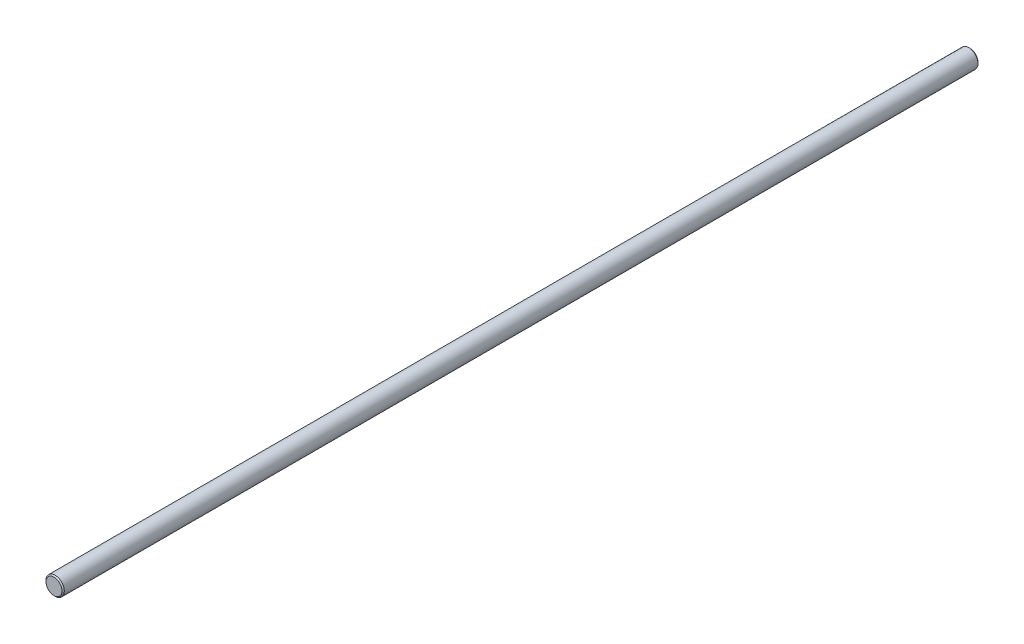
ISO-10303-21;
HEADER;
FILE_DESCRIPTION(('STEP AP214'),'2;1');
FILE_NAME('part.step','',(''),(''),'','','');
FILE_SCHEMA(('AUTOMOTIVE_DESIGN { 1 0 10303 214 1 1 1 1 }'));
ENDSEC;
DATA;
#1=APPLICATION_CONTEXT('core data for automotive mechanical design processes');
#2=APPLICATION_PROTOCOL_DEFINITION('international standard','automotive_design',2000,#1);
#3=PRODUCT_CONTEXT('',#1,'mechanical');
#4=PRODUCT('Part','Part','',(#3));
#5=PRODUCT_RELATED_PRODUCT_CATEGORY('part','',(#4));
#6=PRODUCT_DEFINITION_FORMATION('','',#4);
#7=PRODUCT_DEFINITION_CONTEXT('part definition',#1,'design');
#8=PRODUCT_DEFINITION('design','',#6,#7);
#9=PRODUCT_DEFINITION_SHAPE('','',#8);
#10=(LENGTH_UNIT() NAMED_UNIT(*) SI_UNIT(.MILLI.,.METRE.));
#11=(NAMED_UNIT(*) PLANE_ANGLE_UNIT() SI_UNIT($,.RADIAN.));
#12=(NAMED_UNIT(*) SI_UNIT($,.STERADIAN.) SOLID_ANGLE_UNIT());
#13=UNCERTAINTY_MEASURE_WITH_UNIT(LENGTH_MEASURE(1.E-05),#10,'distance_accuracy_value','');
#14=(GEOMETRIC_REPRESENTATION_CONTEXT(3) GLOBAL_UNCERTAINTY_ASSIGNED_CONTEXT((#13)) GLOBAL_UNIT_ASSIGNED_CONTEXT((#10,
#11,#12)) REPRESENTATION_CONTEXT('',''));
#15=CARTESIAN_POINT('',(0.,0.,0.));
#16=DIRECTION('',(0.,0.,1.));
#17=DIRECTION('',(1.,0.,0.));
#18=AXIS2_PLACEMENT_3D('',#15,#16,#17);
#19=CARTESIAN_POINT('',(0.,0.,400.));
#20=DIRECTION('',(0.,0.,-1.));
#21=DIRECTION('',(-1.,0.,0.));
#22=AXIS2_PLACEMENT_3D('',#19,#20,#21);
#23=CYLINDRICAL_SURFACE('',#22,4.);
#24=CARTESIAN_POINT('',(0.,0.,399.5));
#25=DIRECTION('',(0.,0.,1.));
#26=DIRECTION('',(1.,0.,0.));
#27=AXIS2_PLACEMENT_3D('',#24,#25,#26);
#28=CIRCLE('',#27,4.);
#29=CARTESIAN_POINT('',(4.,0.,399.5));
#30=VERTEX_POINT('',#29);
#31=EDGE_CURVE('E45',#30,#30,#28,.F.);
#32=ORIENTED_EDGE('',*,*,#31,.T.);
#33=EDGE_LOOP('',(#32));
#34=FACE_BOUND('',#33,.T.);
#35=CARTESIAN_POINT('',(0.,0.,0.5));
#36=DIRECTION('',(0.,0.,1.));
#37=DIRECTION('',(1.,0.,0.));
#38=AXIS2_PLACEMENT_3D('',#35,#36,#37);
#39=CIRCLE('',#38,4.);
#40=CARTESIAN_POINT('',(4.,0.,0.5));
#41=VERTEX_POINT('',#40);
#42=EDGE_CURVE('E51',#41,#41,#39,.T.);
#43=ORIENTED_EDGE('',*,*,#42,.T.);
#44=EDGE_LOOP('',(#43));
#45=FACE_BOUND('',#44,.T.);
#46=ADVANCED_FACE('F37',(#34,#45),#23,.T.);
#47=CARTESIAN_POINT('',(0.,0.,400.));
#48=DIRECTION('',(0.,0.,1.));
#49=DIRECTION('',(1.,0.,0.));
#50=AXIS2_PLACEMENT_3D('',#47,#48,#49);
#51=PLANE('',#50);
#52=CARTESIAN_POINT('',(0.,0.,400.));
#53=DIRECTION('',(0.,0.,1.));
#54=DIRECTION('',(1.,0.,0.));
#55=AXIS2_PLACEMENT_3D('',#52,#53,#54);
#56=CIRCLE('',#55,3.49999999999989);
#57=CARTESIAN_POINT('',(3.49999999999989,0.,400.));
#58=VERTEX_POINT('',#57);
#59=EDGE_CURVE('E56',#58,#58,#56,.T.);
#60=ORIENTED_EDGE('',*,*,#59,.T.);
#61=EDGE_LOOP('',(#60));
#62=FACE_BOUND('',#61,.T.);
#63=ADVANCED_FACE('F62',(#62),#51,.T.);
#64=CARTESIAN_POINT('',(0.,0.,0.));
#65=DIRECTION('',(0.,0.,1.));
#66=DIRECTION('',(1.,0.,0.));
#67=AXIS2_PLACEMENT_3D('',#64,#65,#66);
#68=PLANE('',#67);
#69=CARTESIAN_POINT('',(0.,0.,0.));
#70=DIRECTION('',(0.,0.,1.));
#71=DIRECTION('',(1.,0.,0.));
#72=AXIS2_PLACEMENT_3D('',#69,#70,#71);
#73=CIRCLE('',#72,3.49999999999995);
#74=CARTESIAN_POINT('',(3.49999999999995,0.,0.));
#75=VERTEX_POINT('',#74);
#76=EDGE_CURVE('E10',#75,#75,#73,.F.);
#77=ORIENTED_EDGE('',*,*,#76,.T.);
#78=EDGE_LOOP('',(#77));
#79=FACE_BOUND('',#78,.T.);
#80=ADVANCED_FACE('F66',(#79),#68,.F.);
#81=CARTESIAN_POINT('',(0.,0.,400.));
#82=DIRECTION('',(0.,0.,-1.));
#83=DIRECTION('',(-1.,0.,0.));
#84=AXIS2_PLACEMENT_3D('',#81,#82,#83);
#85=CONICAL_SURFACE('',#84,3.49999999999989,0.7853981633975);
#86=ORIENTED_EDGE('',*,*,#31,.F.);
#87=EDGE_LOOP('',(#86));
#88=FACE_BOUND('',#87,.T.);
#89=ORIENTED_EDGE('',*,*,#59,.F.);
#90=EDGE_LOOP('',(#89));
#91=FACE_BOUND('',#90,.T.);
#92=ADVANCED_FACE('F64',(#88,#91),#85,.T.);
#93=CARTESIAN_POINT('',(0.,0.,0.5));
#94=DIRECTION('',(0.,0.,1.));
#95=DIRECTION('',(1.,0.,0.));
#96=AXIS2_PLACEMENT_3D('',#93,#94,#95);
#97=CONICAL_SURFACE('',#96,4.,0.7853981633975);
#98=ORIENTED_EDGE('',*,*,#76,.F.);
#99=EDGE_LOOP('',(#98));
#100=FACE_BOUND('',#99,.T.);
#101=ORIENTED_EDGE('',*,*,#42,.F.);
#102=EDGE_LOOP('',(#101));
#103=FACE_BOUND('',#102,.T.);
#104=ADVANCED_FACE('F39',(#100,#103),#97,.T.);
#105=CLOSED_SHELL('',(#46,#63,#80,#92,#104));
#106=MANIFOLD_SOLID_BREP('B2',#105);
#107=ADVANCED_BREP_SHAPE_REPRESENTATION('',(#18,#106),#14);
#108=SHAPE_DEFINITION_REPRESENTATION(#9,#107);
ENDSEC;
END-ISO-10303-21;
